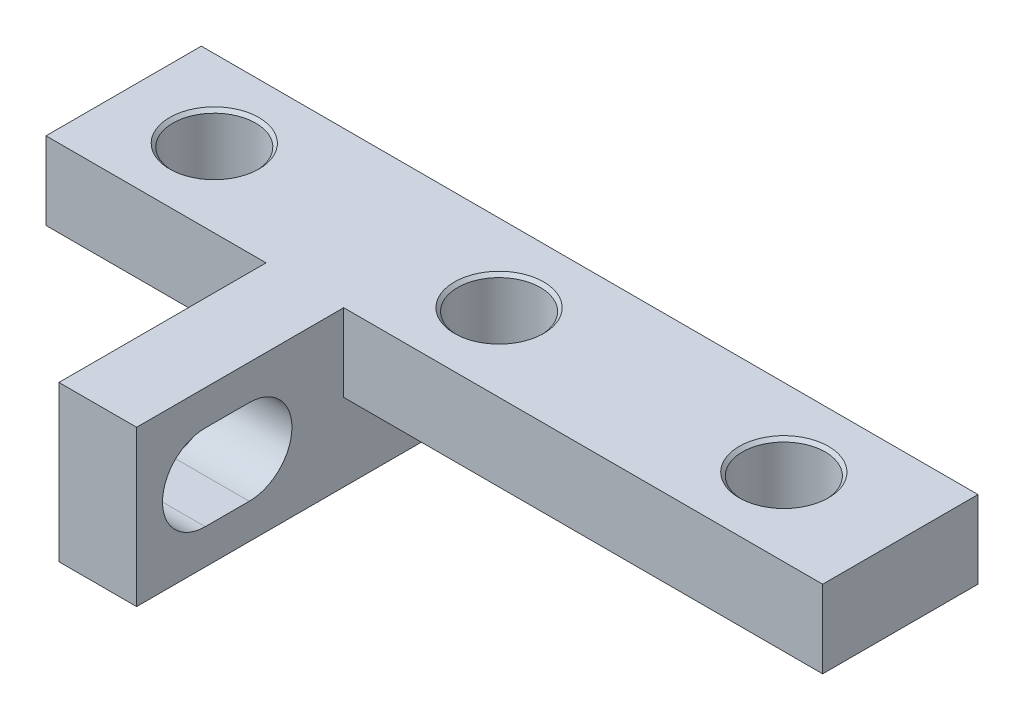
ISO-10303-21;
HEADER;
FILE_DESCRIPTION(('STEP AP214'),'2;1');
FILE_NAME('part.step','',(''),(''),'','','');
FILE_SCHEMA(('AUTOMOTIVE_DESIGN { 1 0 10303 214 1 1 1 1 }'));
ENDSEC;
DATA;
#1=APPLICATION_CONTEXT('core data for automotive mechanical design processes');
#2=APPLICATION_PROTOCOL_DEFINITION('international standard','automotive_design',2000,#1);
#3=PRODUCT_CONTEXT('',#1,'mechanical');
#4=PRODUCT('Part','Part','',(#3));
#5=PRODUCT_RELATED_PRODUCT_CATEGORY('part','',(#4));
#6=PRODUCT_DEFINITION_FORMATION('','',#4);
#7=PRODUCT_DEFINITION_CONTEXT('part definition',#1,'design');
#8=PRODUCT_DEFINITION('design','',#6,#7);
#9=PRODUCT_DEFINITION_SHAPE('','',#8);
#10=(LENGTH_UNIT() NAMED_UNIT(*) SI_UNIT(.MILLI.,.METRE.));
#11=(NAMED_UNIT(*) PLANE_ANGLE_UNIT() SI_UNIT($,.RADIAN.));
#12=(NAMED_UNIT(*) SI_UNIT($,.STERADIAN.) SOLID_ANGLE_UNIT());
#13=UNCERTAINTY_MEASURE_WITH_UNIT(LENGTH_MEASURE(1.E-05),#10,'distance_accuracy_value','');
#14=(GEOMETRIC_REPRESENTATION_CONTEXT(3) GLOBAL_UNCERTAINTY_ASSIGNED_CONTEXT((#13)) GLOBAL_UNIT_ASSIGNED_CONTEXT((#10,
#11,#12)) REPRESENTATION_CONTEXT('',''));
#15=CARTESIAN_POINT('',(0.,0.,0.));
#16=DIRECTION('',(0.,0.,1.));
#17=DIRECTION('',(1.,0.,0.));
#18=AXIS2_PLACEMENT_3D('',#15,#16,#17);
#19=CARTESIAN_POINT('',(-1.5,0.,14.));
#20=DIRECTION('',(0.,0.,-1.));
#21=DIRECTION('',(-1.,0.,0.));
#22=AXIS2_PLACEMENT_3D('',#19,#20,#21);
#23=PLANE('',#22);
#24=DIRECTION('',(0.,1.,0.));
#25=VECTOR('',#24,1.);
#26=CARTESIAN_POINT('',(1.5,22.,14.));
#27=LINE('',#26,#25);
#28=CARTESIAN_POINT('',(1.5,19.,14.));
#29=VERTEX_POINT('',#28);
#30=CARTESIAN_POINT('',(1.5,25.,14.));
#31=VERTEX_POINT('',#30);
#32=EDGE_CURVE('E250',#29,#31,#27,.T.);
#33=ORIENTED_EDGE('',*,*,#32,.T.);
#34=DIRECTION('',(-1.,0.,0.));
#35=VECTOR('',#34,1.);
#36=CARTESIAN_POINT('',(-20.,25.,14.));
#37=LINE('',#36,#35);
#38=CARTESIAN_POINT('',(-1.5,25.,14.));
#39=VERTEX_POINT('',#38);
#40=EDGE_CURVE('E252',#31,#39,#37,.T.);
#41=ORIENTED_EDGE('',*,*,#40,.T.);
#42=DIRECTION('',(0.,-1.,0.));
#43=VECTOR('',#42,1.);
#44=CARTESIAN_POINT('',(-1.5,0.,14.));
#45=LINE('',#44,#43);
#46=CARTESIAN_POINT('',(-1.5,19.,14.));
#47=VERTEX_POINT('',#46);
#48=EDGE_CURVE('E255',#39,#47,#45,.T.);
#49=ORIENTED_EDGE('',*,*,#48,.T.);
#50=DIRECTION('',(1.,0.,0.));
#51=VECTOR('',#50,1.);
#52=CARTESIAN_POINT('',(-1.70134195115599,19.,14.));
#53=LINE('',#52,#51);
#54=EDGE_CURVE('E224',#47,#29,#53,.T.);
#55=ORIENTED_EDGE('',*,*,#54,.T.);
#56=EDGE_LOOP('',(#33,#41,#49,#55));
#57=FACE_BOUND('',#56,.T.);
#58=ADVANCED_FACE('F33',(#57),#23,.F.);
#59=CARTESIAN_POINT('',(1.5,22.,14.));
#60=DIRECTION('',(-1.,0.,0.));
#61=DIRECTION('',(0.,-1.,0.));
#62=AXIS2_PLACEMENT_3D('',#59,#60,#61);
#63=PLANE('',#62);
#64=DIRECTION('',(0.,0.,-1.));
#65=VECTOR('',#64,1.);
#66=CARTESIAN_POINT('',(1.5,20.35,11.35));
#67=LINE('',#66,#65);
#68=CARTESIAN_POINT('',(1.5,20.35,11.35));
#69=VERTEX_POINT('',#68);
#70=CARTESIAN_POINT('',(1.5,20.35,9.65000000000001));
#71=VERTEX_POINT('',#70);
#72=EDGE_CURVE('E155',#69,#71,#67,.T.);
#73=ORIENTED_EDGE('',*,*,#72,.F.);
#74=CARTESIAN_POINT('',(1.5,22.,11.35));
#75=DIRECTION('',(1.,0.,0.));
#76=DIRECTION('',(0.,1.,0.));
#77=AXIS2_PLACEMENT_3D('',#74,#75,#76);
#78=CIRCLE('',#77,1.65);
#79=CARTESIAN_POINT('',(1.5,23.65,11.35));
#80=VERTEX_POINT('',#79);
#81=EDGE_CURVE('E48',#80,#69,#78,.T.);
#82=ORIENTED_EDGE('',*,*,#81,.F.);
#83=DIRECTION('',(0.,0.,1.));
#84=VECTOR('',#83,1.);
#85=CARTESIAN_POINT('',(1.5,23.65,11.35));
#86=LINE('',#85,#84);
#87=CARTESIAN_POINT('',(1.5,23.65,9.65000000000001));
#88=VERTEX_POINT('',#87);
#89=EDGE_CURVE('E141',#88,#80,#86,.T.);
#90=ORIENTED_EDGE('',*,*,#89,.F.);
#91=CARTESIAN_POINT('',(1.5,22.,9.65000000000001));
#92=DIRECTION('',(1.,0.,0.));
#93=DIRECTION('',(0.,1.,0.));
#94=AXIS2_PLACEMENT_3D('',#91,#92,#93);
#95=CIRCLE('',#94,1.65);
#96=EDGE_CURVE('E161',#71,#88,#95,.T.);
#97=ORIENTED_EDGE('',*,*,#96,.F.);
#98=EDGE_LOOP('',(#73,#82,#90,#97));
#99=FACE_BOUND('',#98,.T.);
#100=DIRECTION('',(0.,0.,1.));
#101=VECTOR('',#100,1.);
#102=CARTESIAN_POINT('',(1.5,19.,0.));
#103=LINE('',#102,#101);
#104=CARTESIAN_POINT('',(1.5,19.,0.));
#105=VERTEX_POINT('',#104);
#106=EDGE_CURVE('E236',#105,#29,#103,.T.);
#107=ORIENTED_EDGE('',*,*,#106,.F.);
#108=DIRECTION('',(0.,1.,0.));
#109=VECTOR('',#108,1.);
#110=CARTESIAN_POINT('',(1.5,22.,0.));
#111=LINE('',#110,#109);
#112=CARTESIAN_POINT('',(1.5,22.,0.));
#113=VERTEX_POINT('',#112);
#114=EDGE_CURVE('E247',#105,#113,#111,.T.);
#115=ORIENTED_EDGE('',*,*,#114,.T.);
#116=DIRECTION('',(0.,0.,-1.));
#117=VECTOR('',#116,1.);
#118=CARTESIAN_POINT('',(1.5,22.,14.));
#119=LINE('',#118,#117);
#120=CARTESIAN_POINT('',(1.5,22.,6.));
#121=VERTEX_POINT('',#120);
#122=EDGE_CURVE('E12',#121,#113,#119,.T.);
#123=ORIENTED_EDGE('',*,*,#122,.F.);
#124=DIRECTION('',(0.,1.,0.));
#125=VECTOR('',#124,1.);
#126=CARTESIAN_POINT('',(1.5,-1.93805977429964,6.));
#127=LINE('',#126,#125);
#128=CARTESIAN_POINT('',(1.5,25.,6.));
#129=VERTEX_POINT('',#128);
#130=EDGE_CURVE('E205',#121,#129,#127,.T.);
#131=ORIENTED_EDGE('',*,*,#130,.T.);
#132=DIRECTION('',(0.,0.,1.));
#133=VECTOR('',#132,1.);
#134=CARTESIAN_POINT('',(1.5,25.,-18.7416648139913));
#135=LINE('',#134,#133);
#136=EDGE_CURVE('E213',#129,#31,#135,.T.);
#137=ORIENTED_EDGE('',*,*,#136,.T.);
#138=ORIENTED_EDGE('',*,*,#32,.F.);
#139=EDGE_LOOP('',(#107,#115,#123,#131,#137,#138));
#140=FACE_BOUND('',#139,.T.);
#141=ADVANCED_FACE('F35',(#99,#140),#63,.F.);
#142=CARTESIAN_POINT('',(-1.5,0.,14.));
#143=DIRECTION('',(1.,0.,0.));
#144=DIRECTION('',(0.,1.,0.));
#145=AXIS2_PLACEMENT_3D('',#142,#143,#144);
#146=PLANE('',#145);
#147=DIRECTION('',(0.,0.,-1.));
#148=VECTOR('',#147,1.);
#149=CARTESIAN_POINT('',(-1.5,23.65,11.35));
#150=LINE('',#149,#148);
#151=CARTESIAN_POINT('',(-1.5,23.65,11.35));
#152=VERTEX_POINT('',#151);
#153=CARTESIAN_POINT('',(-1.5,23.65,9.65000000000001));
#154=VERTEX_POINT('',#153);
#155=EDGE_CURVE('E153',#152,#154,#150,.T.);
#156=ORIENTED_EDGE('',*,*,#155,.F.);
#157=CARTESIAN_POINT('',(-1.5,22.,11.35));
#158=DIRECTION('',(1.,0.,0.));
#159=DIRECTION('',(0.,1.,0.));
#160=AXIS2_PLACEMENT_3D('',#157,#158,#159);
#161=CIRCLE('',#160,1.65);
#162=CARTESIAN_POINT('',(-1.5,20.35,11.35));
#163=VERTEX_POINT('',#162);
#164=EDGE_CURVE('E135',#163,#152,#161,.F.);
#165=ORIENTED_EDGE('',*,*,#164,.F.);
#166=DIRECTION('',(0.,0.,1.));
#167=VECTOR('',#166,1.);
#168=CARTESIAN_POINT('',(-1.5,20.35,11.35));
#169=LINE('',#168,#167);
#170=CARTESIAN_POINT('',(-1.5,20.35,9.65000000000001));
#171=VERTEX_POINT('',#170);
#172=EDGE_CURVE('E144',#171,#163,#169,.T.);
#173=ORIENTED_EDGE('',*,*,#172,.F.);
#174=CARTESIAN_POINT('',(-1.5,22.,9.65000000000001));
#175=DIRECTION('',(1.,0.,0.));
#176=DIRECTION('',(0.,1.,0.));
#177=AXIS2_PLACEMENT_3D('',#174,#175,#176);
#178=CIRCLE('',#177,1.65);
#179=EDGE_CURVE('E56',#154,#171,#178,.F.);
#180=ORIENTED_EDGE('',*,*,#179,.F.);
#181=EDGE_LOOP('',(#156,#165,#173,#180));
#182=FACE_BOUND('',#181,.T.);
#183=DIRECTION('',(0.,0.,1.));
#184=VECTOR('',#183,1.);
#185=CARTESIAN_POINT('',(-1.5,19.,0.));
#186=LINE('',#185,#184);
#187=CARTESIAN_POINT('',(-1.5,19.,0.));
#188=VERTEX_POINT('',#187);
#189=EDGE_CURVE('E233',#188,#47,#186,.T.);
#190=ORIENTED_EDGE('',*,*,#189,.T.);
#191=ORIENTED_EDGE('',*,*,#48,.F.);
#192=DIRECTION('',(0.,0.,1.));
#193=VECTOR('',#192,1.);
#194=CARTESIAN_POINT('',(-1.5,25.,-18.7416648139913));
#195=LINE('',#194,#193);
#196=CARTESIAN_POINT('',(-1.5,25.,6.));
#197=VERTEX_POINT('',#196);
#198=EDGE_CURVE('E220',#197,#39,#195,.T.);
#199=ORIENTED_EDGE('',*,*,#198,.F.);
#200=DIRECTION('',(0.,1.,0.));
#201=VECTOR('',#200,1.);
#202=CARTESIAN_POINT('',(-1.5,-1.93805977429964,6.));
#203=LINE('',#202,#201);
#204=CARTESIAN_POINT('',(-1.5,22.,6.));
#205=VERTEX_POINT('',#204);
#206=EDGE_CURVE('E217',#205,#197,#203,.T.);
#207=ORIENTED_EDGE('',*,*,#206,.F.);
#208=DIRECTION('',(0.,0.,-1.));
#209=VECTOR('',#208,1.);
#210=CARTESIAN_POINT('',(-1.5,22.,14.));
#211=LINE('',#210,#209);
#212=CARTESIAN_POINT('',(-1.5,22.,0.));
#213=VERTEX_POINT('',#212);
#214=EDGE_CURVE('E258',#205,#213,#211,.T.);
#215=ORIENTED_EDGE('',*,*,#214,.T.);
#216=DIRECTION('',(0.,-1.,0.));
#217=VECTOR('',#216,1.);
#218=CARTESIAN_POINT('',(-1.5,0.,0.));
#219=LINE('',#218,#217);
#220=EDGE_CURVE('E253',#213,#188,#219,.T.);
#221=ORIENTED_EDGE('',*,*,#220,.T.);
#222=EDGE_LOOP('',(#190,#191,#199,#207,#215,#221));
#223=FACE_BOUND('',#222,.T.);
#224=ADVANCED_FACE('F150',(#182,#223),#146,.F.);
#225=CARTESIAN_POINT('',(-1.5,0.,0.));
#226=DIRECTION('',(0.,0.,-1.));
#227=DIRECTION('',(-1.,0.,0.));
#228=AXIS2_PLACEMENT_3D('',#225,#226,#227);
#229=PLANE('',#228);
#230=ORIENTED_EDGE('',*,*,#114,.F.);
#231=DIRECTION('',(1.,0.,0.));
#232=VECTOR('',#231,1.);
#233=CARTESIAN_POINT('',(-1.70134195115599,19.,0.));
#234=LINE('',#233,#232);
#235=EDGE_CURVE('E231',#188,#105,#234,.T.);
#236=ORIENTED_EDGE('',*,*,#235,.F.);
#237=ORIENTED_EDGE('',*,*,#220,.F.);
#238=DIRECTION('',(1.,0.,0.));
#239=VECTOR('',#238,1.);
#240=CARTESIAN_POINT('',(-1.5,22.,0.));
#241=LINE('',#240,#239);
#242=CARTESIAN_POINT('',(-10.,22.,0.));
#243=VERTEX_POINT('',#242);
#244=EDGE_CURVE('E270',#243,#213,#241,.T.);
#245=ORIENTED_EDGE('',*,*,#244,.F.);
#246=DIRECTION('',(0.,1.,0.));
#247=VECTOR('',#246,1.);
#248=CARTESIAN_POINT('',(-10.,-17.0672097771335,0.));
#249=LINE('',#248,#247);
#250=CARTESIAN_POINT('',(-10.,25.,0.));
#251=VERTEX_POINT('',#250);
#252=EDGE_CURVE('E238',#243,#251,#249,.T.);
#253=ORIENTED_EDGE('',*,*,#252,.T.);
#254=DIRECTION('',(-1.,0.,0.));
#255=VECTOR('',#254,1.);
#256=CARTESIAN_POINT('',(-20.,25.,0.));
#257=LINE('',#256,#255);
#258=CARTESIAN_POINT('',(20.,25.,0.));
#259=VERTEX_POINT('',#258);
#260=EDGE_CURVE('E267',#259,#251,#257,.T.);
#261=ORIENTED_EDGE('',*,*,#260,.F.);
#262=DIRECTION('',(0.,1.,0.));
#263=VECTOR('',#262,1.);
#264=CARTESIAN_POINT('',(20.,25.,0.));
#265=LINE('',#264,#263);
#266=CARTESIAN_POINT('',(20.,22.,0.));
#267=VERTEX_POINT('',#266);
#268=EDGE_CURVE('E264',#267,#259,#265,.T.);
#269=ORIENTED_EDGE('',*,*,#268,.F.);
#270=DIRECTION('',(1.,0.,0.));
#271=VECTOR('',#270,1.);
#272=CARTESIAN_POINT('',(20.,22.,0.));
#273=LINE('',#272,#271);
#274=EDGE_CURVE('E261',#113,#267,#273,.T.);
#275=ORIENTED_EDGE('',*,*,#274,.F.);
#276=EDGE_LOOP('',(#230,#236,#237,#245,#253,#261,#269,#275));
#277=FACE_BOUND('',#276,.T.);
#278=ADVANCED_FACE('F291',(#277),#229,.T.);
#279=CARTESIAN_POINT('',(20.,22.,14.));
#280=DIRECTION('',(0.,1.,0.));
#281=DIRECTION('',(-1.,0.,0.));
#282=AXIS2_PLACEMENT_3D('',#279,#280,#281);
#283=PLANE('',#282);
#284=CARTESIAN_POINT('',(15.5,22.,3.));
#285=DIRECTION('',(0.,-1.,0.));
#286=DIRECTION('',(0.,0.,-1.));
#287=AXIS2_PLACEMENT_3D('',#284,#285,#286);
#288=CIRCLE('',#287,1.725);
#289=CARTESIAN_POINT('',(15.5,22.,1.275));
#290=VERTEX_POINT('',#289);
#291=EDGE_CURVE('E184',#290,#290,#288,.T.);
#292=ORIENTED_EDGE('',*,*,#291,.F.);
#293=EDGE_LOOP('',(#292));
#294=FACE_BOUND('',#293,.T.);
#295=CARTESIAN_POINT('',(4.5,22.,3.));
#296=DIRECTION('',(0.,-1.,0.));
#297=DIRECTION('',(0.,0.,-1.));
#298=AXIS2_PLACEMENT_3D('',#295,#296,#297);
#299=CIRCLE('',#298,1.725);
#300=CARTESIAN_POINT('',(4.5,22.,1.275));
#301=VERTEX_POINT('',#300);
#302=EDGE_CURVE('E196',#301,#301,#299,.T.);
#303=ORIENTED_EDGE('',*,*,#302,.F.);
#304=EDGE_LOOP('',(#303));
#305=FACE_BOUND('',#304,.T.);
#306=DIRECTION('',(0.,0.,-1.));
#307=VECTOR('',#306,1.);
#308=CARTESIAN_POINT('',(20.,22.,14.));
#309=LINE('',#308,#307);
#310=CARTESIAN_POINT('',(20.,22.,6.));
#311=VERTEX_POINT('',#310);
#312=EDGE_CURVE('E41',#311,#267,#309,.T.);
#313=ORIENTED_EDGE('',*,*,#312,.F.);
#314=DIRECTION('',(1.,0.,0.));
#315=VECTOR('',#314,1.);
#316=CARTESIAN_POINT('',(5.00000000000001,22.,6.));
#317=LINE('',#316,#315);
#318=EDGE_CURVE('E206',#121,#311,#317,.T.);
#319=ORIENTED_EDGE('',*,*,#318,.F.);
#320=ORIENTED_EDGE('',*,*,#122,.T.);
#321=ORIENTED_EDGE('',*,*,#274,.T.);
#322=EDGE_LOOP('',(#313,#319,#320,#321));
#323=FACE_BOUND('',#322,.T.);
#324=ADVANCED_FACE('F287',(#294,#305,#323),#283,.F.);
#325=CARTESIAN_POINT('',(20.,25.,14.));
#326=DIRECTION('',(-1.,0.,0.));
#327=DIRECTION('',(0.,0.,1.));
#328=AXIS2_PLACEMENT_3D('',#325,#326,#327);
#329=PLANE('',#328);
#330=DIRECTION('',(0.,0.,-1.));
#331=VECTOR('',#330,1.);
#332=CARTESIAN_POINT('',(20.,25.,14.));
#333=LINE('',#332,#331);
#334=CARTESIAN_POINT('',(20.,25.,6.));
#335=VERTEX_POINT('',#334);
#336=EDGE_CURVE('E276',#335,#259,#333,.T.);
#337=ORIENTED_EDGE('',*,*,#336,.F.);
#338=DIRECTION('',(0.,1.,0.));
#339=VECTOR('',#338,1.);
#340=CARTESIAN_POINT('',(20.,-1.93805977429964,6.));
#341=LINE('',#340,#339);
#342=EDGE_CURVE('E208',#311,#335,#341,.T.);
#343=ORIENTED_EDGE('',*,*,#342,.F.);
#344=ORIENTED_EDGE('',*,*,#312,.T.);
#345=ORIENTED_EDGE('',*,*,#268,.T.);
#346=EDGE_LOOP('',(#337,#343,#344,#345));
#347=FACE_BOUND('',#346,.T.);
#348=ADVANCED_FACE('F281',(#347),#329,.F.);
#349=CARTESIAN_POINT('',(-20.,25.,14.));
#350=DIRECTION('',(0.,-1.,0.));
#351=DIRECTION('',(0.,0.,-1.));
#352=AXIS2_PLACEMENT_3D('',#349,#350,#351);
#353=PLANE('',#352);
#354=CARTESIAN_POINT('',(-6.5,25.,3.));
#355=DIRECTION('',(0.,-1.,0.));
#356=DIRECTION('',(0.,0.,-1.));
#357=AXIS2_PLACEMENT_3D('',#354,#355,#356);
#358=CIRCLE('',#357,1.725);
#359=CARTESIAN_POINT('',(-6.5,25.,1.275));
#360=VERTEX_POINT('',#359);
#361=EDGE_CURVE('E147',#360,#360,#358,.T.);
#362=ORIENTED_EDGE('',*,*,#361,.T.);
#363=EDGE_LOOP('',(#362));
#364=FACE_BOUND('',#363,.T.);
#365=CARTESIAN_POINT('',(15.5,25.,3.));
#366=DIRECTION('',(0.,-1.,0.));
#367=DIRECTION('',(0.,0.,-1.));
#368=AXIS2_PLACEMENT_3D('',#365,#366,#367);
#369=CIRCLE('',#368,1.725);
#370=CARTESIAN_POINT('',(15.5,25.,1.275));
#371=VERTEX_POINT('',#370);
#372=EDGE_CURVE('E181',#371,#371,#369,.T.);
#373=ORIENTED_EDGE('',*,*,#372,.T.);
#374=EDGE_LOOP('',(#373));
#375=FACE_BOUND('',#374,.T.);
#376=CARTESIAN_POINT('',(4.5,25.,3.));
#377=DIRECTION('',(0.,-1.,0.));
#378=DIRECTION('',(0.,0.,-1.));
#379=AXIS2_PLACEMENT_3D('',#376,#377,#378);
#380=CIRCLE('',#379,1.725);
#381=CARTESIAN_POINT('',(4.5,25.,1.275));
#382=VERTEX_POINT('',#381);
#383=EDGE_CURVE('E193',#382,#382,#380,.T.);
#384=ORIENTED_EDGE('',*,*,#383,.T.);
#385=EDGE_LOOP('',(#384));
#386=FACE_BOUND('',#385,.T.);
#387=ORIENTED_EDGE('',*,*,#136,.F.);
#388=DIRECTION('',(-1.,0.,0.));
#389=VECTOR('',#388,1.);
#390=CARTESIAN_POINT('',(5.,25.,6.));
#391=LINE('',#390,#389);
#392=EDGE_CURVE('E211',#335,#129,#391,.T.);
#393=ORIENTED_EDGE('',*,*,#392,.F.);
#394=ORIENTED_EDGE('',*,*,#336,.T.);
#395=ORIENTED_EDGE('',*,*,#260,.T.);
#396=DIRECTION('',(0.,0.,1.));
#397=VECTOR('',#396,1.);
#398=CARTESIAN_POINT('',(-10.,25.,0.));
#399=LINE('',#398,#397);
#400=CARTESIAN_POINT('',(-10.,25.,6.));
#401=VERTEX_POINT('',#400);
#402=EDGE_CURVE('E244',#251,#401,#399,.T.);
#403=ORIENTED_EDGE('',*,*,#402,.T.);
#404=DIRECTION('',(-1.,0.,0.));
#405=VECTOR('',#404,1.);
#406=CARTESIAN_POINT('',(5.,25.,6.));
#407=LINE('',#406,#405);
#408=EDGE_CURVE('E227',#197,#401,#407,.T.);
#409=ORIENTED_EDGE('',*,*,#408,.F.);
#410=ORIENTED_EDGE('',*,*,#198,.T.);
#411=ORIENTED_EDGE('',*,*,#40,.F.);
#412=EDGE_LOOP('',(#387,#393,#394,#395,#403,#409,#410,#411));
#413=FACE_BOUND('',#412,.T.);
#414=ADVANCED_FACE('F295',(#364,#375,#386,#413),#353,.F.);
#415=CARTESIAN_POINT('',(-1.5,22.,14.));
#416=DIRECTION('',(0.,1.,0.));
#417=DIRECTION('',(-1.,0.,0.));
#418=AXIS2_PLACEMENT_3D('',#415,#416,#417);
#419=PLANE('',#418);
#420=CARTESIAN_POINT('',(-6.5,22.,3.));
#421=DIRECTION('',(0.,-1.,0.));
#422=DIRECTION('',(0.,0.,-1.));
#423=AXIS2_PLACEMENT_3D('',#420,#421,#422);
#424=CIRCLE('',#423,1.725);
#425=CARTESIAN_POINT('',(-6.5,22.,1.275));
#426=VERTEX_POINT('',#425);
#427=EDGE_CURVE('E172',#426,#426,#424,.T.);
#428=ORIENTED_EDGE('',*,*,#427,.F.);
#429=EDGE_LOOP('',(#428));
#430=FACE_BOUND('',#429,.T.);
#431=ORIENTED_EDGE('',*,*,#214,.F.);
#432=DIRECTION('',(1.,0.,0.));
#433=VECTOR('',#432,1.);
#434=CARTESIAN_POINT('',(5.,22.,6.));
#435=LINE('',#434,#433);
#436=CARTESIAN_POINT('',(-10.,22.,6.));
#437=VERTEX_POINT('',#436);
#438=EDGE_CURVE('E221',#437,#205,#435,.T.);
#439=ORIENTED_EDGE('',*,*,#438,.F.);
#440=DIRECTION('',(0.,0.,1.));
#441=VECTOR('',#440,1.);
#442=CARTESIAN_POINT('',(-10.,22.,0.));
#443=LINE('',#442,#441);
#444=EDGE_CURVE('E243',#243,#437,#443,.T.);
#445=ORIENTED_EDGE('',*,*,#444,.F.);
#446=ORIENTED_EDGE('',*,*,#244,.T.);
#447=EDGE_LOOP('',(#431,#439,#445,#446));
#448=FACE_BOUND('',#447,.T.);
#449=ADVANCED_FACE('F312',(#430,#448),#419,.F.);
#450=CARTESIAN_POINT('',(-10.,-17.0672097771335,0.));
#451=DIRECTION('',(1.,0.,0.));
#452=DIRECTION('',(0.,0.,-1.));
#453=AXIS2_PLACEMENT_3D('',#450,#451,#452);
#454=PLANE('',#453);
#455=ORIENTED_EDGE('',*,*,#444,.T.);
#456=DIRECTION('',(0.,-1.,0.));
#457=VECTOR('',#456,1.);
#458=CARTESIAN_POINT('',(-10.,-1.93805977429964,6.));
#459=LINE('',#458,#457);
#460=EDGE_CURVE('E225',#401,#437,#459,.T.);
#461=ORIENTED_EDGE('',*,*,#460,.F.);
#462=ORIENTED_EDGE('',*,*,#402,.F.);
#463=ORIENTED_EDGE('',*,*,#252,.F.);
#464=EDGE_LOOP('',(#455,#461,#462,#463));
#465=FACE_BOUND('',#464,.T.);
#466=ADVANCED_FACE('F315',(#465),#454,.F.);
#467=CARTESIAN_POINT('',(-1.70134195115599,19.,0.));
#468=DIRECTION('',(0.,-1.,0.));
#469=DIRECTION('',(0.,0.,-1.));
#470=AXIS2_PLACEMENT_3D('',#467,#468,#469);
#471=PLANE('',#470);
#472=ORIENTED_EDGE('',*,*,#54,.F.);
#473=ORIENTED_EDGE('',*,*,#189,.F.);
#474=ORIENTED_EDGE('',*,*,#235,.T.);
#475=ORIENTED_EDGE('',*,*,#106,.T.);
#476=EDGE_LOOP('',(#472,#473,#474,#475));
#477=FACE_BOUND('',#476,.T.);
#478=ADVANCED_FACE('F319',(#477),#471,.T.);
#479=CARTESIAN_POINT('',(-1.5,0.,6.));
#480=DIRECTION('',(0.,0.,-1.));
#481=DIRECTION('',(-1.,0.,0.));
#482=AXIS2_PLACEMENT_3D('',#479,#480,#481);
#483=PLANE('',#482);
#484=ORIENTED_EDGE('',*,*,#438,.T.);
#485=ORIENTED_EDGE('',*,*,#206,.T.);
#486=ORIENTED_EDGE('',*,*,#408,.T.);
#487=ORIENTED_EDGE('',*,*,#460,.T.);
#488=EDGE_LOOP('',(#484,#485,#486,#487));
#489=FACE_BOUND('',#488,.T.);
#490=ADVANCED_FACE('F317',(#489),#483,.F.);
#491=CARTESIAN_POINT('',(-1.5,0.,6.));
#492=DIRECTION('',(0.,0.,-1.));
#493=DIRECTION('',(-1.,0.,0.));
#494=AXIS2_PLACEMENT_3D('',#491,#492,#493);
#495=PLANE('',#494);
#496=ORIENTED_EDGE('',*,*,#318,.T.);
#497=ORIENTED_EDGE('',*,*,#342,.T.);
#498=ORIENTED_EDGE('',*,*,#392,.T.);
#499=ORIENTED_EDGE('',*,*,#130,.F.);
#500=EDGE_LOOP('',(#496,#497,#498,#499));
#501=FACE_BOUND('',#500,.T.);
#502=ADVANCED_FACE('F300',(#501),#495,.F.);
#503=CARTESIAN_POINT('',(4.5,24.875,3.));
#504=DIRECTION('',(0.,1.,0.));
#505=DIRECTION('',(0.,0.,1.));
#506=AXIS2_PLACEMENT_3D('',#503,#504,#505);
#507=CONICAL_SURFACE('',#506,1.6,0.785398163397448);
#508=ORIENTED_EDGE('',*,*,#383,.F.);
#509=EDGE_LOOP('',(#508));
#510=FACE_BOUND('',#509,.T.);
#511=CARTESIAN_POINT('',(4.5,24.875,3.));
#512=DIRECTION('',(0.,-1.,0.));
#513=DIRECTION('',(0.,0.,-1.));
#514=AXIS2_PLACEMENT_3D('',#511,#512,#513);
#515=CIRCLE('',#514,1.6);
#516=CARTESIAN_POINT('',(4.5,24.875,1.4));
#517=VERTEX_POINT('',#516);
#518=EDGE_CURVE('E202',#517,#517,#515,.T.);
#519=ORIENTED_EDGE('',*,*,#518,.T.);
#520=EDGE_LOOP('',(#519));
#521=FACE_BOUND('',#520,.T.);
#522=ADVANCED_FACE('F367',(#510,#521),#507,.F.);
#523=CARTESIAN_POINT('',(4.5,22.,3.));
#524=DIRECTION('',(0.,-1.,0.));
#525=DIRECTION('',(0.,0.,-1.));
#526=AXIS2_PLACEMENT_3D('',#523,#524,#525);
#527=CYLINDRICAL_SURFACE('',#526,1.6);
#528=ORIENTED_EDGE('',*,*,#518,.F.);
#529=EDGE_LOOP('',(#528));
#530=FACE_BOUND('',#529,.T.);
#531=CARTESIAN_POINT('',(4.5,22.125,3.));
#532=DIRECTION('',(0.,-1.,0.));
#533=DIRECTION('',(0.,0.,-1.));
#534=AXIS2_PLACEMENT_3D('',#531,#532,#533);
#535=CIRCLE('',#534,1.6);
#536=CARTESIAN_POINT('',(4.5,22.125,1.4));
#537=VERTEX_POINT('',#536);
#538=EDGE_CURVE('E199',#537,#537,#535,.T.);
#539=ORIENTED_EDGE('',*,*,#538,.T.);
#540=EDGE_LOOP('',(#539));
#541=FACE_BOUND('',#540,.T.);
#542=ADVANCED_FACE('F357',(#530,#541),#527,.F.);
#543=CARTESIAN_POINT('',(4.5,22.,3.));
#544=DIRECTION('',(0.,-1.,0.));
#545=DIRECTION('',(0.,0.,-1.));
#546=AXIS2_PLACEMENT_3D('',#543,#544,#545);
#547=CONICAL_SURFACE('',#546,1.725,0.785398163397438);
#548=ORIENTED_EDGE('',*,*,#538,.F.);
#549=EDGE_LOOP('',(#548));
#550=FACE_BOUND('',#549,.T.);
#551=ORIENTED_EDGE('',*,*,#302,.T.);
#552=EDGE_LOOP('',(#551));
#553=FACE_BOUND('',#552,.T.);
#554=ADVANCED_FACE('F354',(#550,#553),#547,.F.);
#555=CARTESIAN_POINT('',(15.5,24.875,3.));
#556=DIRECTION('',(0.,1.,0.));
#557=DIRECTION('',(0.,0.,1.));
#558=AXIS2_PLACEMENT_3D('',#555,#556,#557);
#559=CONICAL_SURFACE('',#558,1.6,0.785398163397448);
#560=ORIENTED_EDGE('',*,*,#372,.F.);
#561=EDGE_LOOP('',(#560));
#562=FACE_BOUND('',#561,.T.);
#563=CARTESIAN_POINT('',(15.5,24.875,3.));
#564=DIRECTION('',(0.,-1.,0.));
#565=DIRECTION('',(0.,0.,-1.));
#566=AXIS2_PLACEMENT_3D('',#563,#564,#565);
#567=CIRCLE('',#566,1.6);
#568=CARTESIAN_POINT('',(15.5,24.875,1.4));
#569=VERTEX_POINT('',#568);
#570=EDGE_CURVE('E190',#569,#569,#567,.T.);
#571=ORIENTED_EDGE('',*,*,#570,.T.);
#572=EDGE_LOOP('',(#571));
#573=FACE_BOUND('',#572,.T.);
#574=ADVANCED_FACE('F356',(#562,#573),#559,.F.);
#575=CARTESIAN_POINT('',(15.5,22.,3.));
#576=DIRECTION('',(0.,-1.,0.));
#577=DIRECTION('',(0.,0.,-1.));
#578=AXIS2_PLACEMENT_3D('',#575,#576,#577);
#579=CYLINDRICAL_SURFACE('',#578,1.6);
#580=ORIENTED_EDGE('',*,*,#570,.F.);
#581=EDGE_LOOP('',(#580));
#582=FACE_BOUND('',#581,.T.);
#583=CARTESIAN_POINT('',(15.5,22.125,3.));
#584=DIRECTION('',(0.,-1.,0.));
#585=DIRECTION('',(0.,0.,-1.));
#586=AXIS2_PLACEMENT_3D('',#583,#584,#585);
#587=CIRCLE('',#586,1.6);
#588=CARTESIAN_POINT('',(15.5,22.125,1.4));
#589=VERTEX_POINT('',#588);
#590=EDGE_CURVE('E187',#589,#589,#587,.T.);
#591=ORIENTED_EDGE('',*,*,#590,.T.);
#592=EDGE_LOOP('',(#591));
#593=FACE_BOUND('',#592,.T.);
#594=ADVANCED_FACE('F364',(#582,#593),#579,.F.);
#595=CARTESIAN_POINT('',(15.5,22.,3.));
#596=DIRECTION('',(0.,-1.,0.));
#597=DIRECTION('',(0.,0.,-1.));
#598=AXIS2_PLACEMENT_3D('',#595,#596,#597);
#599=CONICAL_SURFACE('',#598,1.725,0.785398163397448);
#600=ORIENTED_EDGE('',*,*,#590,.F.);
#601=EDGE_LOOP('',(#600));
#602=FACE_BOUND('',#601,.T.);
#603=ORIENTED_EDGE('',*,*,#291,.T.);
#604=EDGE_LOOP('',(#603));
#605=FACE_BOUND('',#604,.T.);
#606=ADVANCED_FACE('F409',(#602,#605),#599,.F.);
#607=CARTESIAN_POINT('',(-6.5,24.875,3.));
#608=DIRECTION('',(0.,1.,0.));
#609=DIRECTION('',(0.,0.,1.));
#610=AXIS2_PLACEMENT_3D('',#607,#608,#609);
#611=CONICAL_SURFACE('',#610,1.6,0.785398163397448);
#612=ORIENTED_EDGE('',*,*,#361,.F.);
#613=EDGE_LOOP('',(#612));
#614=FACE_BOUND('',#613,.T.);
#615=CARTESIAN_POINT('',(-6.5,24.875,3.));
#616=DIRECTION('',(0.,-1.,0.));
#617=DIRECTION('',(0.,0.,-1.));
#618=AXIS2_PLACEMENT_3D('',#615,#616,#617);
#619=CIRCLE('',#618,1.6);
#620=CARTESIAN_POINT('',(-6.5,24.875,1.4));
#621=VERTEX_POINT('',#620);
#622=EDGE_CURVE('E178',#621,#621,#619,.T.);
#623=ORIENTED_EDGE('',*,*,#622,.T.);
#624=EDGE_LOOP('',(#623));
#625=FACE_BOUND('',#624,.T.);
#626=ADVANCED_FACE('F418',(#614,#625),#611,.F.);
#627=CARTESIAN_POINT('',(-6.5,22.,3.));
#628=DIRECTION('',(0.,-1.,0.));
#629=DIRECTION('',(0.,0.,-1.));
#630=AXIS2_PLACEMENT_3D('',#627,#628,#629);
#631=CYLINDRICAL_SURFACE('',#630,1.6);
#632=ORIENTED_EDGE('',*,*,#622,.F.);
#633=EDGE_LOOP('',(#632));
#634=FACE_BOUND('',#633,.T.);
#635=CARTESIAN_POINT('',(-6.5,22.125,3.));
#636=DIRECTION('',(0.,-1.,0.));
#637=DIRECTION('',(0.,0.,-1.));
#638=AXIS2_PLACEMENT_3D('',#635,#636,#637);
#639=CIRCLE('',#638,1.6);
#640=CARTESIAN_POINT('',(-6.5,22.125,1.4));
#641=VERTEX_POINT('',#640);
#642=EDGE_CURVE('E175',#641,#641,#639,.T.);
#643=ORIENTED_EDGE('',*,*,#642,.T.);
#644=EDGE_LOOP('',(#643));
#645=FACE_BOUND('',#644,.T.);
#646=ADVANCED_FACE('F428',(#634,#645),#631,.F.);
#647=CARTESIAN_POINT('',(-6.5,22.,3.));
#648=DIRECTION('',(0.,-1.,0.));
#649=DIRECTION('',(0.,0.,-1.));
#650=AXIS2_PLACEMENT_3D('',#647,#648,#649);
#651=CONICAL_SURFACE('',#650,1.725,0.785398163397438);
#652=ORIENTED_EDGE('',*,*,#642,.F.);
#653=EDGE_LOOP('',(#652));
#654=FACE_BOUND('',#653,.T.);
#655=ORIENTED_EDGE('',*,*,#427,.T.);
#656=EDGE_LOOP('',(#655));
#657=FACE_BOUND('',#656,.T.);
#658=ADVANCED_FACE('F438',(#654,#657),#651,.F.);
#659=CARTESIAN_POINT('',(-10.001,22.,11.35));
#660=DIRECTION('',(1.,0.,0.));
#661=DIRECTION('',(0.,1.,0.));
#662=AXIS2_PLACEMENT_3D('',#659,#660,#661);
#663=CYLINDRICAL_SURFACE('',#662,1.65);
#664=ORIENTED_EDGE('',*,*,#164,.T.);
#665=DIRECTION('',(1.,0.,0.));
#666=VECTOR('',#665,1.);
#667=CARTESIAN_POINT('',(-10.001,23.65,11.35));
#668=LINE('',#667,#666);
#669=EDGE_CURVE('E148',#152,#80,#668,.T.);
#670=ORIENTED_EDGE('',*,*,#669,.T.);
#671=ORIENTED_EDGE('',*,*,#81,.T.);
#672=DIRECTION('',(1.,0.,0.));
#673=VECTOR('',#672,1.);
#674=CARTESIAN_POINT('',(-10.001,20.35,11.35));
#675=LINE('',#674,#673);
#676=EDGE_CURVE('E131',#163,#69,#675,.T.);
#677=ORIENTED_EDGE('',*,*,#676,.F.);
#678=EDGE_LOOP('',(#664,#670,#671,#677));
#679=FACE_BOUND('',#678,.T.);
#680=ADVANCED_FACE('F133',(#679),#663,.F.);
#681=CARTESIAN_POINT('',(-10.001,23.65,11.35));
#682=DIRECTION('',(0.,1.,0.));
#683=DIRECTION('',(-1.,0.,0.));
#684=AXIS2_PLACEMENT_3D('',#681,#682,#683);
#685=PLANE('',#684);
#686=ORIENTED_EDGE('',*,*,#155,.T.);
#687=DIRECTION('',(1.,0.,0.));
#688=VECTOR('',#687,1.);
#689=CARTESIAN_POINT('',(-10.001,23.65,9.65000000000001));
#690=LINE('',#689,#688);
#691=EDGE_CURVE('E167',#154,#88,#690,.T.);
#692=ORIENTED_EDGE('',*,*,#691,.T.);
#693=ORIENTED_EDGE('',*,*,#89,.T.);
#694=ORIENTED_EDGE('',*,*,#669,.F.);
#695=EDGE_LOOP('',(#686,#692,#693,#694));
#696=FACE_BOUND('',#695,.T.);
#697=ADVANCED_FACE('F473',(#696),#685,.F.);
#698=CARTESIAN_POINT('',(-10.001,22.,9.65000000000001));
#699=DIRECTION('',(1.,0.,0.));
#700=DIRECTION('',(0.,1.,0.));
#701=AXIS2_PLACEMENT_3D('',#698,#699,#700);
#702=CYLINDRICAL_SURFACE('',#701,1.65);
#703=ORIENTED_EDGE('',*,*,#179,.T.);
#704=DIRECTION('',(1.,0.,0.));
#705=VECTOR('',#704,1.);
#706=CARTESIAN_POINT('',(-10.001,20.35,9.65000000000001));
#707=LINE('',#706,#705);
#708=EDGE_CURVE('E140',#171,#71,#707,.T.);
#709=ORIENTED_EDGE('',*,*,#708,.T.);
#710=ORIENTED_EDGE('',*,*,#96,.T.);
#711=ORIENTED_EDGE('',*,*,#691,.F.);
#712=EDGE_LOOP('',(#703,#709,#710,#711));
#713=FACE_BOUND('',#712,.T.);
#714=ADVANCED_FACE('F482',(#713),#702,.F.);
#715=CARTESIAN_POINT('',(-10.001,20.35,11.35));
#716=DIRECTION('',(0.,-1.,0.));
#717=DIRECTION('',(1.,0.,0.));
#718=AXIS2_PLACEMENT_3D('',#715,#716,#717);
#719=PLANE('',#718);
#720=ORIENTED_EDGE('',*,*,#172,.T.);
#721=ORIENTED_EDGE('',*,*,#676,.T.);
#722=ORIENTED_EDGE('',*,*,#72,.T.);
#723=ORIENTED_EDGE('',*,*,#708,.F.);
#724=EDGE_LOOP('',(#720,#721,#722,#723));
#725=FACE_BOUND('',#724,.T.);
#726=ADVANCED_FACE('F145',(#725),#719,.F.);
#727=CLOSED_SHELL('',(#58,#141,#224,#278,#324,#348,#414,#449,#466,#478,#490,#502,#522,#542,#554,
#574,#594,#606,#626,#646,#658,#680,#697,#714,#726));
#728=MANIFOLD_SOLID_BREP('B2',#727);
#729=ADVANCED_BREP_SHAPE_REPRESENTATION('',(#18,#728),#14);
#730=SHAPE_DEFINITION_REPRESENTATION(#9,#729);
ENDSEC;
END-ISO-10303-21;
